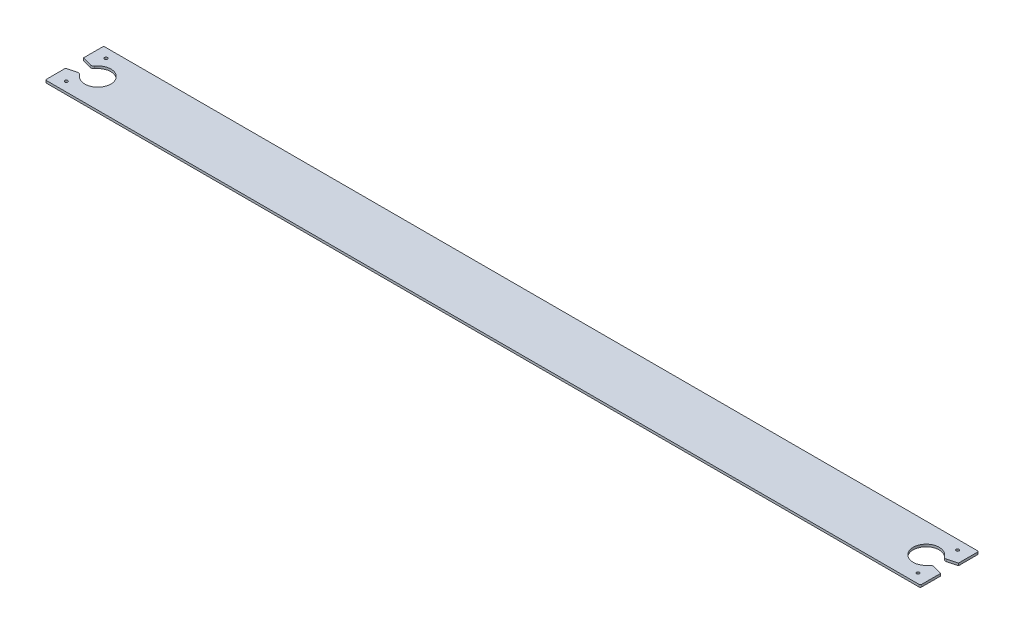
ISO-10303-21;
HEADER;
FILE_DESCRIPTION(('STEP AP214'),'2;1');
FILE_NAME('part.step','',(''),(''),'','','');
FILE_SCHEMA(('AUTOMOTIVE_DESIGN { 1 0 10303 214 1 1 1 1 }'));
ENDSEC;
DATA;
#1=APPLICATION_CONTEXT('core data for automotive mechanical design processes');
#2=APPLICATION_PROTOCOL_DEFINITION('international standard','automotive_design',2000,#1);
#3=PRODUCT_CONTEXT('',#1,'mechanical');
#4=PRODUCT('Part','Part','',(#3));
#5=PRODUCT_RELATED_PRODUCT_CATEGORY('part','',(#4));
#6=PRODUCT_DEFINITION_FORMATION('','',#4);
#7=PRODUCT_DEFINITION_CONTEXT('part definition',#1,'design');
#8=PRODUCT_DEFINITION('design','',#6,#7);
#9=PRODUCT_DEFINITION_SHAPE('','',#8);
#10=(LENGTH_UNIT() NAMED_UNIT(*) SI_UNIT(.MILLI.,.METRE.));
#11=(NAMED_UNIT(*) PLANE_ANGLE_UNIT() SI_UNIT($,.RADIAN.));
#12=(NAMED_UNIT(*) SI_UNIT($,.STERADIAN.) SOLID_ANGLE_UNIT());
#13=UNCERTAINTY_MEASURE_WITH_UNIT(LENGTH_MEASURE(1.E-05),#10,'distance_accuracy_value','');
#14=(GEOMETRIC_REPRESENTATION_CONTEXT(3) GLOBAL_UNCERTAINTY_ASSIGNED_CONTEXT((#13)) GLOBAL_UNIT_ASSIGNED_CONTEXT((#10,
#11,#12)) REPRESENTATION_CONTEXT('',''));
#15=CARTESIAN_POINT('',(0.,0.,0.));
#16=DIRECTION('',(0.,0.,1.));
#17=DIRECTION('',(1.,0.,0.));
#18=AXIS2_PLACEMENT_3D('',#15,#16,#17);
#19=CARTESIAN_POINT('',(0.,2.,0.));
#20=DIRECTION('',(1.,0.,0.));
#21=DIRECTION('',(0.,0.,-1.));
#22=AXIS2_PLACEMENT_3D('',#19,#20,#21);
#23=PLANE('',#22);
#24=DIRECTION('',(0.,0.,1.));
#25=VECTOR('',#24,1.);
#26=CARTESIAN_POINT('',(0.,0.,0.));
#27=LINE('',#26,#25);
#28=CARTESIAN_POINT('',(0.,0.,-49.));
#29=VERTEX_POINT('',#28);
#30=CARTESIAN_POINT('',(0.,0.,-32.6794919243113));
#31=VERTEX_POINT('',#30);
#32=EDGE_CURVE('E299',#29,#31,#27,.T.);
#33=ORIENTED_EDGE('',*,*,#32,.T.);
#34=DIRECTION('',(0.,1.,0.));
#35=VECTOR('',#34,1.);
#36=CARTESIAN_POINT('',(0.,-38.3694356943123,-32.6794919243113));
#37=LINE('',#36,#35);
#38=CARTESIAN_POINT('',(0.,2.,-32.6794919243113));
#39=VERTEX_POINT('',#38);
#40=EDGE_CURVE('E252',#31,#39,#37,.T.);
#41=ORIENTED_EDGE('',*,*,#40,.T.);
#42=DIRECTION('',(0.,0.,1.));
#43=VECTOR('',#42,1.);
#44=CARTESIAN_POINT('',(0.,2.,0.));
#45=LINE('',#44,#43);
#46=CARTESIAN_POINT('',(0.,2.,-49.));
#47=VERTEX_POINT('',#46);
#48=EDGE_CURVE('E284',#47,#39,#45,.T.);
#49=ORIENTED_EDGE('',*,*,#48,.F.);
#50=DIRECTION('',(0.,-1.,0.));
#51=VECTOR('',#50,1.);
#52=CARTESIAN_POINT('',(0.,2.,-49.));
#53=LINE('',#52,#51);
#54=EDGE_CURVE('E324',#47,#29,#53,.T.);
#55=ORIENTED_EDGE('',*,*,#54,.T.);
#56=EDGE_LOOP('',(#33,#41,#49,#55));
#57=FACE_BOUND('',#56,.T.);
#58=ADVANCED_FACE('F34',(#57),#23,.F.);
#59=CARTESIAN_POINT('',(750.,2.,0.));
#60=DIRECTION('',(-1.,0.,0.));
#61=DIRECTION('',(0.,0.,1.));
#62=AXIS2_PLACEMENT_3D('',#59,#60,#61);
#63=PLANE('',#62);
#64=DIRECTION('',(0.,0.,-1.));
#65=VECTOR('',#64,1.);
#66=CARTESIAN_POINT('',(750.,2.,0.));
#67=LINE('',#66,#65);
#68=CARTESIAN_POINT('',(750.,2.,-32.6794919243113));
#69=VERTEX_POINT('',#68);
#70=CARTESIAN_POINT('',(750.,2.,-49.0000000000001));
#71=VERTEX_POINT('',#70);
#72=EDGE_CURVE('E291',#69,#71,#67,.T.);
#73=ORIENTED_EDGE('',*,*,#72,.F.);
#74=DIRECTION('',(0.,1.,0.));
#75=VECTOR('',#74,1.);
#76=CARTESIAN_POINT('',(750.,-38.3694356943123,-32.6794919243113));
#77=LINE('',#76,#75);
#78=CARTESIAN_POINT('',(750.,0.,-32.6794919243113));
#79=VERTEX_POINT('',#78);
#80=EDGE_CURVE('E214',#79,#69,#77,.T.);
#81=ORIENTED_EDGE('',*,*,#80,.F.);
#82=DIRECTION('',(0.,0.,-1.));
#83=VECTOR('',#82,1.);
#84=CARTESIAN_POINT('',(750.,0.,0.));
#85=LINE('',#84,#83);
#86=CARTESIAN_POINT('',(750.,0.,-49.0000000000001));
#87=VERTEX_POINT('',#86);
#88=EDGE_CURVE('E195',#79,#87,#85,.T.);
#89=ORIENTED_EDGE('',*,*,#88,.T.);
#90=DIRECTION('',(0.,-1.,0.));
#91=VECTOR('',#90,1.);
#92=CARTESIAN_POINT('',(750.,2.,-49.0000000000001));
#93=LINE('',#92,#91);
#94=EDGE_CURVE('E11',#87,#71,#93,.F.);
#95=ORIENTED_EDGE('',*,*,#94,.T.);
#96=EDGE_LOOP('',(#73,#81,#89,#95));
#97=FACE_BOUND('',#96,.T.);
#98=ADVANCED_FACE('F414',(#97),#63,.F.);
#99=CARTESIAN_POINT('',(0.,2.,0.));
#100=DIRECTION('',(0.,-1.,0.));
#101=DIRECTION('',(0.,0.,-1.));
#102=AXIS2_PLACEMENT_3D('',#99,#100,#101);
#103=PLANE('',#102);
#104=CARTESIAN_POINT('',(741.167970771759,2.,-32.9011472761012));
#105=DIRECTION('',(0.,-1.,0.));
#106=DIRECTION('',(0.,0.,1.));
#107=AXIS2_PLACEMENT_3D('',#104,#105,#106);
#108=CIRCLE('',#107,2.49999999999995);
#109=CARTESIAN_POINT('',(741.815018384515,2.,-30.4863327103785));
#110=VERTEX_POINT('',#109);
#111=CARTESIAN_POINT('',(739.127091147495,2.,-31.4572600369908));
#112=VERTEX_POINT('',#111);
#113=EDGE_CURVE('E415',#110,#112,#108,.T.);
#114=ORIENTED_EDGE('',*,*,#113,.F.);
#115=DIRECTION('',(-0.965925826289071,0.,0.25881904510251));
#116=VECTOR('',#115,1.);
#117=CARTESIAN_POINT('',(741.815018384515,2.,-30.4863327103785));
#118=LINE('',#117,#116);
#119=EDGE_CURVE('E188',#69,#110,#118,.T.);
#120=ORIENTED_EDGE('',*,*,#119,.F.);
#121=ORIENTED_EDGE('',*,*,#72,.T.);
#122=CARTESIAN_POINT('',(749.,2.,-49.0000000000001));
#123=DIRECTION('',(0.,-1.,0.));
#124=DIRECTION('',(0.,0.,-1.));
#125=AXIS2_PLACEMENT_3D('',#122,#123,#124);
#126=CIRCLE('',#125,1.);
#127=CARTESIAN_POINT('',(749.,2.,-50.0000000000001));
#128=VERTEX_POINT('',#127);
#129=EDGE_CURVE('E332',#71,#128,#126,.F.);
#130=ORIENTED_EDGE('',*,*,#129,.T.);
#131=DIRECTION('',(-1.,0.,0.));
#132=VECTOR('',#131,1.);
#133=CARTESIAN_POINT('',(0.,2.,-50.));
#134=LINE('',#133,#132);
#135=CARTESIAN_POINT('',(1.,2.,-50.));
#136=VERTEX_POINT('',#135);
#137=EDGE_CURVE('E295',#128,#136,#134,.T.);
#138=ORIENTED_EDGE('',*,*,#137,.T.);
#139=CARTESIAN_POINT('',(1.,2.,-49.));
#140=DIRECTION('',(0.,-1.,0.));
#141=DIRECTION('',(0.,0.,-1.));
#142=AXIS2_PLACEMENT_3D('',#139,#140,#141);
#143=CIRCLE('',#142,1.);
#144=EDGE_CURVE('E334',#136,#47,#143,.F.);
#145=ORIENTED_EDGE('',*,*,#144,.T.);
#146=ORIENTED_EDGE('',*,*,#48,.T.);
#147=DIRECTION('',(-0.965925826289071,0.,-0.25881904510251));
#148=VECTOR('',#147,1.);
#149=CARTESIAN_POINT('',(8.1849816154852,2.,-30.4863327103785));
#150=LINE('',#149,#148);
#151=CARTESIAN_POINT('',(8.18498161548521,2.,-30.4863327103786));
#152=VERTEX_POINT('',#151);
#153=EDGE_CURVE('E227',#152,#39,#150,.T.);
#154=ORIENTED_EDGE('',*,*,#153,.F.);
#155=CARTESIAN_POINT('',(8.83202922824145,2.,-32.9011472761012));
#156=DIRECTION('',(0.,-1.,0.));
#157=DIRECTION('',(0.,0.,-1.));
#158=AXIS2_PLACEMENT_3D('',#155,#156,#157);
#159=CIRCLE('',#158,2.49999999999995);
#160=CARTESIAN_POINT('',(10.8729088525049,2.,-31.4572600369908));
#161=VERTEX_POINT('',#160);
#162=EDGE_CURVE('E229',#161,#152,#159,.T.);
#163=ORIENTED_EDGE('',*,*,#162,.F.);
#164=CARTESIAN_POINT('',(20.,2.,-25.0000000000001));
#165=DIRECTION('',(0.,1.,0.));
#166=DIRECTION('',(0.,0.,-1.));
#167=AXIS2_PLACEMENT_3D('',#164,#165,#166);
#168=CIRCLE('',#167,11.1803398874989);
#169=CARTESIAN_POINT('',(10.872908852505,2.,-18.5427399630094));
#170=VERTEX_POINT('',#169);
#171=EDGE_CURVE('E232',#170,#161,#168,.T.);
#172=ORIENTED_EDGE('',*,*,#171,.F.);
#173=CARTESIAN_POINT('',(8.83202922824145,2.,-17.098852723899));
#174=DIRECTION('',(0.,-1.,0.));
#175=DIRECTION('',(0.,0.,-1.));
#176=AXIS2_PLACEMENT_3D('',#173,#174,#175);
#177=CIRCLE('',#176,2.50000000000001);
#178=CARTESIAN_POINT('',(8.1849816154852,2.,-19.5136672896217));
#179=VERTEX_POINT('',#178);
#180=EDGE_CURVE('E220',#179,#170,#177,.T.);
#181=ORIENTED_EDGE('',*,*,#180,.F.);
#182=DIRECTION('',(0.965925826289072,0.,-0.258819045102508));
#183=VECTOR('',#182,1.);
#184=CARTESIAN_POINT('',(8.1849816154852,2.,-19.5136672896217));
#185=LINE('',#184,#183);
#186=CARTESIAN_POINT('',(0.,2.,-17.3205080756889));
#187=VERTEX_POINT('',#186);
#188=EDGE_CURVE('E224',#187,#179,#185,.T.);
#189=ORIENTED_EDGE('',*,*,#188,.F.);
#190=CARTESIAN_POINT('',(0.,2.,-1.));
#191=VERTEX_POINT('',#190);
#192=EDGE_CURVE('E288',#187,#191,#45,.T.);
#193=ORIENTED_EDGE('',*,*,#192,.T.);
#194=CARTESIAN_POINT('',(1.,2.,-1.));
#195=DIRECTION('',(0.,-1.,0.));
#196=DIRECTION('',(0.,0.,-1.));
#197=AXIS2_PLACEMENT_3D('',#194,#195,#196);
#198=CIRCLE('',#197,1.);
#199=CARTESIAN_POINT('',(1.,2.,0.));
#200=VERTEX_POINT('',#199);
#201=EDGE_CURVE('E336',#191,#200,#198,.F.);
#202=ORIENTED_EDGE('',*,*,#201,.T.);
#203=DIRECTION('',(1.,0.,0.));
#204=VECTOR('',#203,1.);
#205=CARTESIAN_POINT('',(0.,2.,0.));
#206=LINE('',#205,#204);
#207=CARTESIAN_POINT('',(749.,2.,0.));
#208=VERTEX_POINT('',#207);
#209=EDGE_CURVE('E287',#200,#208,#206,.T.);
#210=ORIENTED_EDGE('',*,*,#209,.T.);
#211=CARTESIAN_POINT('',(749.,2.,-1.00000000000009));
#212=DIRECTION('',(0.,-1.,0.));
#213=DIRECTION('',(0.,0.,-1.));
#214=AXIS2_PLACEMENT_3D('',#211,#212,#213);
#215=CIRCLE('',#214,1.);
#216=CARTESIAN_POINT('',(750.,2.,-1.00000000000009));
#217=VERTEX_POINT('',#216);
#218=EDGE_CURVE('E330',#208,#217,#215,.F.);
#219=ORIENTED_EDGE('',*,*,#218,.T.);
#220=CARTESIAN_POINT('',(750.,2.,-17.3205080756889));
#221=VERTEX_POINT('',#220);
#222=EDGE_CURVE('E292',#217,#221,#67,.T.);
#223=ORIENTED_EDGE('',*,*,#222,.T.);
#224=DIRECTION('',(0.965925826289071,0.,0.25881904510251));
#225=VECTOR('',#224,1.);
#226=CARTESIAN_POINT('',(741.815018384515,2.,-19.5136672896217));
#227=LINE('',#226,#225);
#228=CARTESIAN_POINT('',(741.815018384515,2.,-19.5136672896216));
#229=VERTEX_POINT('',#228);
#230=EDGE_CURVE('E57',#229,#221,#227,.T.);
#231=ORIENTED_EDGE('',*,*,#230,.F.);
#232=CARTESIAN_POINT('',(741.167970771759,2.,-17.098852723899));
#233=DIRECTION('',(0.,-1.,0.));
#234=DIRECTION('',(0.,0.,1.));
#235=AXIS2_PLACEMENT_3D('',#232,#233,#234);
#236=CIRCLE('',#235,2.49999999999997);
#237=CARTESIAN_POINT('',(739.127091147495,2.,-18.5427399630094));
#238=VERTEX_POINT('',#237);
#239=EDGE_CURVE('E197',#238,#229,#236,.T.);
#240=ORIENTED_EDGE('',*,*,#239,.F.);
#241=CARTESIAN_POINT('',(730.,2.,-25.0000000000001));
#242=DIRECTION('',(0.,1.,0.));
#243=DIRECTION('',(0.,0.,1.));
#244=AXIS2_PLACEMENT_3D('',#241,#242,#243);
#245=CIRCLE('',#244,11.180339887499);
#246=EDGE_CURVE('E361',#112,#238,#245,.T.);
#247=ORIENTED_EDGE('',*,*,#246,.F.);
#248=EDGE_LOOP('',(#114,#120,#121,#130,#138,#145,#146,#154,#163,#172,#181,#189,#193,#202,#210,
#219,#223,#231,#240,#247));
#249=FACE_BOUND('',#248,.T.);
#250=CARTESIAN_POINT('',(10.,2.,-42.));
#251=DIRECTION('',(0.,1.,0.));
#252=DIRECTION('',(0.,0.,1.));
#253=AXIS2_PLACEMENT_3D('',#250,#251,#252);
#254=CIRCLE('',#253,1.25);
#255=CARTESIAN_POINT('',(10.,2.,-40.75));
#256=VERTEX_POINT('',#255);
#257=EDGE_CURVE('E278',#256,#256,#254,.T.);
#258=ORIENTED_EDGE('',*,*,#257,.F.);
#259=EDGE_LOOP('',(#258));
#260=FACE_BOUND('',#259,.T.);
#261=CARTESIAN_POINT('',(10.,2.,-8.));
#262=DIRECTION('',(0.,1.,0.));
#263=DIRECTION('',(0.,0.,1.));
#264=AXIS2_PLACEMENT_3D('',#261,#262,#263);
#265=CIRCLE('',#264,1.25);
#266=CARTESIAN_POINT('',(10.,2.,-6.75));
#267=VERTEX_POINT('',#266);
#268=EDGE_CURVE('E272',#267,#267,#265,.T.);
#269=ORIENTED_EDGE('',*,*,#268,.F.);
#270=EDGE_LOOP('',(#269));
#271=FACE_BOUND('',#270,.T.);
#272=CARTESIAN_POINT('',(740.,2.,-8.00000000000009));
#273=DIRECTION('',(0.,1.,0.));
#274=DIRECTION('',(0.,0.,-1.));
#275=AXIS2_PLACEMENT_3D('',#272,#273,#274);
#276=CIRCLE('',#275,1.24999999999996);
#277=CARTESIAN_POINT('',(740.,2.,-9.25000000000005));
#278=VERTEX_POINT('',#277);
#279=EDGE_CURVE('E266',#278,#278,#276,.T.);
#280=ORIENTED_EDGE('',*,*,#279,.F.);
#281=EDGE_LOOP('',(#280));
#282=FACE_BOUND('',#281,.T.);
#283=CARTESIAN_POINT('',(740.,2.,-42.0000000000001));
#284=DIRECTION('',(0.,1.,0.));
#285=DIRECTION('',(0.,0.,-1.));
#286=AXIS2_PLACEMENT_3D('',#283,#284,#285);
#287=CIRCLE('',#286,1.24999999999996);
#288=CARTESIAN_POINT('',(740.,2.,-43.25));
#289=VERTEX_POINT('',#288);
#290=EDGE_CURVE('E260',#289,#289,#287,.T.);
#291=ORIENTED_EDGE('',*,*,#290,.F.);
#292=EDGE_LOOP('',(#291));
#293=FACE_BOUND('',#292,.T.);
#294=ADVANCED_FACE('F363',(#249,#260,#271,#282,#293),#103,.F.);
#295=CARTESIAN_POINT('',(0.,0.,0.));
#296=DIRECTION('',(0.,-1.,0.));
#297=DIRECTION('',(0.,0.,-1.));
#298=AXIS2_PLACEMENT_3D('',#295,#296,#297);
#299=PLANE('',#298);
#300=DIRECTION('',(-0.965925826289071,0.,0.25881904510251));
#301=VECTOR('',#300,1.);
#302=CARTESIAN_POINT('',(741.815018384515,0.,-30.4863327103785));
#303=LINE('',#302,#301);
#304=CARTESIAN_POINT('',(741.815018384515,0.,-30.4863327103785));
#305=VERTEX_POINT('',#304);
#306=EDGE_CURVE('E185',#79,#305,#303,.T.);
#307=ORIENTED_EDGE('',*,*,#306,.T.);
#308=CARTESIAN_POINT('',(741.167970771759,0.,-32.9011472761012));
#309=DIRECTION('',(0.,-1.,0.));
#310=DIRECTION('',(0.,0.,-1.));
#311=AXIS2_PLACEMENT_3D('',#308,#309,#310);
#312=CIRCLE('',#311,2.49999999999995);
#313=CARTESIAN_POINT('',(739.127091147495,0.,-31.4572600369908));
#314=VERTEX_POINT('',#313);
#315=EDGE_CURVE('E172',#305,#314,#312,.T.);
#316=ORIENTED_EDGE('',*,*,#315,.T.);
#317=CARTESIAN_POINT('',(730.,0.,-25.0000000000001));
#318=DIRECTION('',(0.,-1.,0.));
#319=DIRECTION('',(0.,0.,-1.));
#320=AXIS2_PLACEMENT_3D('',#317,#318,#319);
#321=CIRCLE('',#320,11.180339887499);
#322=CARTESIAN_POINT('',(739.127091147495,0.,-18.5427399630094));
#323=VERTEX_POINT('',#322);
#324=EDGE_CURVE('E211',#314,#323,#321,.F.);
#325=ORIENTED_EDGE('',*,*,#324,.T.);
#326=CARTESIAN_POINT('',(741.167970771759,0.,-17.098852723899));
#327=DIRECTION('',(0.,-1.,0.));
#328=DIRECTION('',(0.,0.,-1.));
#329=AXIS2_PLACEMENT_3D('',#326,#327,#328);
#330=CIRCLE('',#329,2.49999999999997);
#331=CARTESIAN_POINT('',(741.815018384515,0.,-19.5136672896216));
#332=VERTEX_POINT('',#331);
#333=EDGE_CURVE('E207',#323,#332,#330,.T.);
#334=ORIENTED_EDGE('',*,*,#333,.T.);
#335=DIRECTION('',(0.965925826289071,0.,0.25881904510251));
#336=VECTOR('',#335,1.);
#337=CARTESIAN_POINT('',(741.815018384515,0.,-19.5136672896217));
#338=LINE('',#337,#336);
#339=CARTESIAN_POINT('',(750.,0.,-17.3205080756889));
#340=VERTEX_POINT('',#339);
#341=EDGE_CURVE('E202',#332,#340,#338,.T.);
#342=ORIENTED_EDGE('',*,*,#341,.T.);
#343=CARTESIAN_POINT('',(750.,0.,-1.00000000000009));
#344=VERTEX_POINT('',#343);
#345=EDGE_CURVE('E305',#344,#340,#85,.T.);
#346=ORIENTED_EDGE('',*,*,#345,.F.);
#347=CARTESIAN_POINT('',(749.,0.,-1.00000000000009));
#348=DIRECTION('',(0.,-1.,0.));
#349=DIRECTION('',(0.,0.,-1.));
#350=AXIS2_PLACEMENT_3D('',#347,#348,#349);
#351=CIRCLE('',#350,1.);
#352=CARTESIAN_POINT('',(749.,0.,0.));
#353=VERTEX_POINT('',#352);
#354=EDGE_CURVE('E315',#344,#353,#351,.T.);
#355=ORIENTED_EDGE('',*,*,#354,.T.);
#356=DIRECTION('',(1.,0.,0.));
#357=VECTOR('',#356,1.);
#358=CARTESIAN_POINT('',(0.,0.,0.));
#359=LINE('',#358,#357);
#360=CARTESIAN_POINT('',(1.,0.,0.));
#361=VERTEX_POINT('',#360);
#362=EDGE_CURVE('E302',#361,#353,#359,.T.);
#363=ORIENTED_EDGE('',*,*,#362,.F.);
#364=CARTESIAN_POINT('',(1.,0.,-1.));
#365=DIRECTION('',(0.,-1.,0.));
#366=DIRECTION('',(0.,0.,-1.));
#367=AXIS2_PLACEMENT_3D('',#364,#365,#366);
#368=CIRCLE('',#367,1.);
#369=CARTESIAN_POINT('',(0.,0.,-1.));
#370=VERTEX_POINT('',#369);
#371=EDGE_CURVE('E321',#361,#370,#368,.T.);
#372=ORIENTED_EDGE('',*,*,#371,.T.);
#373=CARTESIAN_POINT('',(0.,0.,-17.3205080756889));
#374=VERTEX_POINT('',#373);
#375=EDGE_CURVE('E281',#374,#370,#27,.T.);
#376=ORIENTED_EDGE('',*,*,#375,.F.);
#377=DIRECTION('',(0.965925826289072,0.,-0.258819045102508));
#378=VECTOR('',#377,1.);
#379=CARTESIAN_POINT('',(8.1849816154852,0.,-19.5136672896217));
#380=LINE('',#379,#378);
#381=CARTESIAN_POINT('',(8.1849816154852,0.,-19.5136672896217));
#382=VERTEX_POINT('',#381);
#383=EDGE_CURVE('E49',#374,#382,#380,.T.);
#384=ORIENTED_EDGE('',*,*,#383,.T.);
#385=CARTESIAN_POINT('',(8.83202922824145,0.,-17.098852723899));
#386=DIRECTION('',(0.,-1.,0.));
#387=DIRECTION('',(0.,0.,-1.));
#388=AXIS2_PLACEMENT_3D('',#385,#386,#387);
#389=CIRCLE('',#388,2.50000000000001);
#390=CARTESIAN_POINT('',(10.872908852505,0.,-18.5427399630094));
#391=VERTEX_POINT('',#390);
#392=EDGE_CURVE('E243',#382,#391,#389,.T.);
#393=ORIENTED_EDGE('',*,*,#392,.T.);
#394=CARTESIAN_POINT('',(20.,0.,-25.0000000000001));
#395=DIRECTION('',(0.,-1.,0.));
#396=DIRECTION('',(0.,0.,-1.));
#397=AXIS2_PLACEMENT_3D('',#394,#395,#396);
#398=CIRCLE('',#397,11.1803398874989);
#399=CARTESIAN_POINT('',(10.8729088525049,0.,-31.4572600369908));
#400=VERTEX_POINT('',#399);
#401=EDGE_CURVE('E238',#391,#400,#398,.F.);
#402=ORIENTED_EDGE('',*,*,#401,.T.);
#403=CARTESIAN_POINT('',(8.83202922824145,0.,-32.9011472761012));
#404=DIRECTION('',(0.,-1.,0.));
#405=DIRECTION('',(0.,0.,-1.));
#406=AXIS2_PLACEMENT_3D('',#403,#404,#405);
#407=CIRCLE('',#406,2.49999999999995);
#408=CARTESIAN_POINT('',(8.18498161548521,0.,-30.4863327103786));
#409=VERTEX_POINT('',#408);
#410=EDGE_CURVE('E223',#400,#409,#407,.T.);
#411=ORIENTED_EDGE('',*,*,#410,.T.);
#412=DIRECTION('',(-0.965925826289071,0.,-0.25881904510251));
#413=VECTOR('',#412,1.);
#414=CARTESIAN_POINT('',(8.1849816154852,0.,-30.4863327103785));
#415=LINE('',#414,#413);
#416=EDGE_CURVE('E249',#409,#31,#415,.T.);
#417=ORIENTED_EDGE('',*,*,#416,.T.);
#418=ORIENTED_EDGE('',*,*,#32,.F.);
#419=CARTESIAN_POINT('',(1.,0.,-49.));
#420=DIRECTION('',(0.,-1.,0.));
#421=DIRECTION('',(0.,0.,-1.));
#422=AXIS2_PLACEMENT_3D('',#419,#420,#421);
#423=CIRCLE('',#422,1.);
#424=CARTESIAN_POINT('',(1.,0.,-50.));
#425=VERTEX_POINT('',#424);
#426=EDGE_CURVE('E319',#29,#425,#423,.T.);
#427=ORIENTED_EDGE('',*,*,#426,.T.);
#428=DIRECTION('',(-1.,0.,0.));
#429=VECTOR('',#428,1.);
#430=CARTESIAN_POINT('',(0.,0.,-50.));
#431=LINE('',#430,#429);
#432=CARTESIAN_POINT('',(749.,0.,-50.0000000000001));
#433=VERTEX_POINT('',#432);
#434=EDGE_CURVE('E308',#433,#425,#431,.T.);
#435=ORIENTED_EDGE('',*,*,#434,.F.);
#436=CARTESIAN_POINT('',(749.,0.,-49.0000000000001));
#437=DIRECTION('',(0.,-1.,0.));
#438=DIRECTION('',(0.,0.,-1.));
#439=AXIS2_PLACEMENT_3D('',#436,#437,#438);
#440=CIRCLE('',#439,1.);
#441=EDGE_CURVE('E317',#433,#87,#440,.T.);
#442=ORIENTED_EDGE('',*,*,#441,.T.);
#443=ORIENTED_EDGE('',*,*,#88,.F.);
#444=EDGE_LOOP('',(#307,#316,#325,#334,#342,#346,#355,#363,#372,#376,#384,#393,#402,#411,#417,
#418,#427,#435,#442,#443));
#445=FACE_BOUND('',#444,.T.);
#446=CARTESIAN_POINT('',(740.,0.,-8.00000000000009));
#447=DIRECTION('',(0.,1.,0.));
#448=DIRECTION('',(0.,0.,-1.));
#449=AXIS2_PLACEMENT_3D('',#446,#447,#448);
#450=CIRCLE('',#449,1.24999999999996);
#451=CARTESIAN_POINT('',(740.,0.,-9.25000000000005));
#452=VERTEX_POINT('',#451);
#453=EDGE_CURVE('E263',#452,#452,#450,.T.);
#454=ORIENTED_EDGE('',*,*,#453,.T.);
#455=EDGE_LOOP('',(#454));
#456=FACE_BOUND('',#455,.T.);
#457=CARTESIAN_POINT('',(10.,0.,-42.));
#458=DIRECTION('',(0.,1.,0.));
#459=DIRECTION('',(0.,0.,1.));
#460=AXIS2_PLACEMENT_3D('',#457,#458,#459);
#461=CIRCLE('',#460,1.25);
#462=CARTESIAN_POINT('',(10.,0.,-40.75));
#463=VERTEX_POINT('',#462);
#464=EDGE_CURVE('E275',#463,#463,#461,.T.);
#465=ORIENTED_EDGE('',*,*,#464,.T.);
#466=EDGE_LOOP('',(#465));
#467=FACE_BOUND('',#466,.T.);
#468=CARTESIAN_POINT('',(10.,0.,-8.));
#469=DIRECTION('',(0.,1.,0.));
#470=DIRECTION('',(0.,0.,1.));
#471=AXIS2_PLACEMENT_3D('',#468,#469,#470);
#472=CIRCLE('',#471,1.25);
#473=CARTESIAN_POINT('',(10.,0.,-6.75));
#474=VERTEX_POINT('',#473);
#475=EDGE_CURVE('E269',#474,#474,#472,.T.);
#476=ORIENTED_EDGE('',*,*,#475,.T.);
#477=EDGE_LOOP('',(#476));
#478=FACE_BOUND('',#477,.T.);
#479=CARTESIAN_POINT('',(740.,0.,-42.0000000000001));
#480=DIRECTION('',(0.,1.,0.));
#481=DIRECTION('',(0.,0.,-1.));
#482=AXIS2_PLACEMENT_3D('',#479,#480,#481);
#483=CIRCLE('',#482,1.24999999999996);
#484=CARTESIAN_POINT('',(740.,0.,-43.25));
#485=VERTEX_POINT('',#484);
#486=EDGE_CURVE('E219',#485,#485,#483,.T.);
#487=ORIENTED_EDGE('',*,*,#486,.T.);
#488=EDGE_LOOP('',(#487));
#489=FACE_BOUND('',#488,.T.);
#490=ADVANCED_FACE('F192',(#445,#456,#467,#478,#489),#299,.T.);
#491=ORIENTED_EDGE('',*,*,#192,.F.);
#492=DIRECTION('',(0.,1.,0.));
#493=VECTOR('',#492,1.);
#494=CARTESIAN_POINT('',(0.,-38.3694356943123,-17.3205080756889));
#495=LINE('',#494,#493);
#496=EDGE_CURVE('E248',#374,#187,#495,.T.);
#497=ORIENTED_EDGE('',*,*,#496,.F.);
#498=ORIENTED_EDGE('',*,*,#375,.T.);
#499=DIRECTION('',(0.,-1.,0.));
#500=VECTOR('',#499,1.);
#501=CARTESIAN_POINT('',(0.,2.,-1.));
#502=LINE('',#501,#500);
#503=EDGE_CURVE('E327',#370,#191,#502,.F.);
#504=ORIENTED_EDGE('',*,*,#503,.T.);
#505=EDGE_LOOP('',(#491,#497,#498,#504));
#506=FACE_BOUND('',#505,.T.);
#507=ADVANCED_FACE('F377',(#506),#23,.F.);
#508=CARTESIAN_POINT('',(0.,2.,0.));
#509=DIRECTION('',(0.,0.,-1.));
#510=DIRECTION('',(-1.,0.,0.));
#511=AXIS2_PLACEMENT_3D('',#508,#509,#510);
#512=PLANE('',#511);
#513=ORIENTED_EDGE('',*,*,#209,.F.);
#514=DIRECTION('',(0.,-1.,0.));
#515=VECTOR('',#514,1.);
#516=CARTESIAN_POINT('',(1.,2.,0.));
#517=LINE('',#516,#515);
#518=EDGE_CURVE('E312',#200,#361,#517,.T.);
#519=ORIENTED_EDGE('',*,*,#518,.T.);
#520=ORIENTED_EDGE('',*,*,#362,.T.);
#521=DIRECTION('',(0.,-1.,0.));
#522=VECTOR('',#521,1.);
#523=CARTESIAN_POINT('',(749.,2.,0.));
#524=LINE('',#523,#522);
#525=EDGE_CURVE('E298',#353,#208,#524,.F.);
#526=ORIENTED_EDGE('',*,*,#525,.T.);
#527=EDGE_LOOP('',(#513,#519,#520,#526));
#528=FACE_BOUND('',#527,.T.);
#529=ADVANCED_FACE('F368',(#528),#512,.F.);
#530=ORIENTED_EDGE('',*,*,#345,.T.);
#531=DIRECTION('',(0.,1.,0.));
#532=VECTOR('',#531,1.);
#533=CARTESIAN_POINT('',(750.,-38.3694356943123,-17.3205080756889));
#534=LINE('',#533,#532);
#535=EDGE_CURVE('E205',#340,#221,#534,.T.);
#536=ORIENTED_EDGE('',*,*,#535,.T.);
#537=ORIENTED_EDGE('',*,*,#222,.F.);
#538=DIRECTION('',(0.,-1.,0.));
#539=VECTOR('',#538,1.);
#540=CARTESIAN_POINT('',(750.,2.,-1.00000000000009));
#541=LINE('',#540,#539);
#542=EDGE_CURVE('E42',#217,#344,#541,.T.);
#543=ORIENTED_EDGE('',*,*,#542,.T.);
#544=EDGE_LOOP('',(#530,#536,#537,#543));
#545=FACE_BOUND('',#544,.T.);
#546=ADVANCED_FACE('F347',(#545),#63,.F.);
#547=CARTESIAN_POINT('',(0.,2.,-50.));
#548=DIRECTION('',(0.,0.,1.));
#549=DIRECTION('',(1.,0.,0.));
#550=AXIS2_PLACEMENT_3D('',#547,#548,#549);
#551=PLANE('',#550);
#552=ORIENTED_EDGE('',*,*,#434,.T.);
#553=DIRECTION('',(0.,-1.,0.));
#554=VECTOR('',#553,1.);
#555=CARTESIAN_POINT('',(1.,2.,-50.));
#556=LINE('',#555,#554);
#557=EDGE_CURVE('E341',#425,#136,#556,.F.);
#558=ORIENTED_EDGE('',*,*,#557,.T.);
#559=ORIENTED_EDGE('',*,*,#137,.F.);
#560=DIRECTION('',(0.,-1.,0.));
#561=VECTOR('',#560,1.);
#562=CARTESIAN_POINT('',(749.,2.,-50.0000000000001));
#563=LINE('',#562,#561);
#564=EDGE_CURVE('E338',#128,#433,#563,.T.);
#565=ORIENTED_EDGE('',*,*,#564,.T.);
#566=EDGE_LOOP('',(#552,#558,#559,#565));
#567=FACE_BOUND('',#566,.T.);
#568=ADVANCED_FACE('F405',(#567),#551,.F.);
#569=CARTESIAN_POINT('',(10.,2.,-42.));
#570=DIRECTION('',(0.,-1.,0.));
#571=DIRECTION('',(0.,0.,-1.));
#572=AXIS2_PLACEMENT_3D('',#569,#570,#571);
#573=CYLINDRICAL_SURFACE('',#572,1.25);
#574=ORIENTED_EDGE('',*,*,#257,.T.);
#575=EDGE_LOOP('',(#574));
#576=FACE_BOUND('',#575,.T.);
#577=ORIENTED_EDGE('',*,*,#464,.F.);
#578=EDGE_LOOP('',(#577));
#579=FACE_BOUND('',#578,.T.);
#580=ADVANCED_FACE('F448',(#576,#579),#573,.F.);
#581=CARTESIAN_POINT('',(10.,2.,-8.));
#582=DIRECTION('',(0.,-1.,0.));
#583=DIRECTION('',(0.,0.,-1.));
#584=AXIS2_PLACEMENT_3D('',#581,#582,#583);
#585=CYLINDRICAL_SURFACE('',#584,1.25);
#586=ORIENTED_EDGE('',*,*,#268,.T.);
#587=EDGE_LOOP('',(#586));
#588=FACE_BOUND('',#587,.T.);
#589=ORIENTED_EDGE('',*,*,#475,.F.);
#590=EDGE_LOOP('',(#589));
#591=FACE_BOUND('',#590,.T.);
#592=ADVANCED_FACE('F466',(#588,#591),#585,.F.);
#593=CARTESIAN_POINT('',(740.,2.,-8.00000000000009));
#594=DIRECTION('',(0.,-1.,0.));
#595=DIRECTION('',(0.,0.,-1.));
#596=AXIS2_PLACEMENT_3D('',#593,#594,#595);
#597=CYLINDRICAL_SURFACE('',#596,1.24999999999996);
#598=ORIENTED_EDGE('',*,*,#279,.T.);
#599=EDGE_LOOP('',(#598));
#600=FACE_BOUND('',#599,.T.);
#601=ORIENTED_EDGE('',*,*,#453,.F.);
#602=EDGE_LOOP('',(#601));
#603=FACE_BOUND('',#602,.T.);
#604=ADVANCED_FACE('F473',(#600,#603),#597,.F.);
#605=CARTESIAN_POINT('',(740.,2.,-42.0000000000001));
#606=DIRECTION('',(0.,-1.,0.));
#607=DIRECTION('',(0.,0.,-1.));
#608=AXIS2_PLACEMENT_3D('',#605,#606,#607);
#609=CYLINDRICAL_SURFACE('',#608,1.24999999999996);
#610=ORIENTED_EDGE('',*,*,#290,.T.);
#611=EDGE_LOOP('',(#610));
#612=FACE_BOUND('',#611,.T.);
#613=ORIENTED_EDGE('',*,*,#486,.F.);
#614=EDGE_LOOP('',(#613));
#615=FACE_BOUND('',#614,.T.);
#616=ADVANCED_FACE('F481',(#612,#615),#609,.F.);
#617=CARTESIAN_POINT('',(1.,2.,-1.));
#618=DIRECTION('',(0.,-1.,0.));
#619=DIRECTION('',(0.,0.,-1.));
#620=AXIS2_PLACEMENT_3D('',#617,#618,#619);
#621=CYLINDRICAL_SURFACE('',#620,1.);
#622=ORIENTED_EDGE('',*,*,#201,.F.);
#623=ORIENTED_EDGE('',*,*,#503,.F.);
#624=ORIENTED_EDGE('',*,*,#371,.F.);
#625=ORIENTED_EDGE('',*,*,#518,.F.);
#626=EDGE_LOOP('',(#622,#623,#624,#625));
#627=FACE_BOUND('',#626,.T.);
#628=ADVANCED_FACE('F374',(#627),#621,.T.);
#629=CARTESIAN_POINT('',(1.,2.,-49.));
#630=DIRECTION('',(0.,-1.,0.));
#631=DIRECTION('',(0.,0.,-1.));
#632=AXIS2_PLACEMENT_3D('',#629,#630,#631);
#633=CYLINDRICAL_SURFACE('',#632,1.);
#634=ORIENTED_EDGE('',*,*,#144,.F.);
#635=ORIENTED_EDGE('',*,*,#557,.F.);
#636=ORIENTED_EDGE('',*,*,#426,.F.);
#637=ORIENTED_EDGE('',*,*,#54,.F.);
#638=EDGE_LOOP('',(#634,#635,#636,#637));
#639=FACE_BOUND('',#638,.T.);
#640=ADVANCED_FACE('F401',(#639),#633,.T.);
#641=CARTESIAN_POINT('',(749.,2.,-49.0000000000001));
#642=DIRECTION('',(0.,-1.,0.));
#643=DIRECTION('',(0.,0.,-1.));
#644=AXIS2_PLACEMENT_3D('',#641,#642,#643);
#645=CYLINDRICAL_SURFACE('',#644,1.);
#646=ORIENTED_EDGE('',*,*,#129,.F.);
#647=ORIENTED_EDGE('',*,*,#94,.F.);
#648=ORIENTED_EDGE('',*,*,#441,.F.);
#649=ORIENTED_EDGE('',*,*,#564,.F.);
#650=EDGE_LOOP('',(#646,#647,#648,#649));
#651=FACE_BOUND('',#650,.T.);
#652=ADVANCED_FACE('F410',(#651),#645,.T.);
#653=CARTESIAN_POINT('',(749.,2.,-1.00000000000009));
#654=DIRECTION('',(0.,-1.,0.));
#655=DIRECTION('',(0.,0.,-1.));
#656=AXIS2_PLACEMENT_3D('',#653,#654,#655);
#657=CYLINDRICAL_SURFACE('',#656,1.);
#658=ORIENTED_EDGE('',*,*,#218,.F.);
#659=ORIENTED_EDGE('',*,*,#525,.F.);
#660=ORIENTED_EDGE('',*,*,#354,.F.);
#661=ORIENTED_EDGE('',*,*,#542,.F.);
#662=EDGE_LOOP('',(#658,#659,#660,#661));
#663=FACE_BOUND('',#662,.T.);
#664=ADVANCED_FACE('F36',(#663),#657,.T.);
#665=CARTESIAN_POINT('',(741.815018384515,-38.3694356943123,-30.4863327103785));
#666=DIRECTION('',(-0.25881904510251,0.,-0.965925826289071));
#667=DIRECTION('',(-0.965925826289071,0.,0.25881904510251));
#668=AXIS2_PLACEMENT_3D('',#665,#666,#667);
#669=PLANE('',#668);
#670=ORIENTED_EDGE('',*,*,#80,.T.);
#671=ORIENTED_EDGE('',*,*,#119,.T.);
#672=DIRECTION('',(0.,1.,0.));
#673=VECTOR('',#672,1.);
#674=CARTESIAN_POINT('',(741.815018384515,-38.3694356943123,-30.4863327103785));
#675=LINE('',#674,#673);
#676=EDGE_CURVE('E176',#305,#110,#675,.T.);
#677=ORIENTED_EDGE('',*,*,#676,.F.);
#678=ORIENTED_EDGE('',*,*,#306,.F.);
#679=EDGE_LOOP('',(#670,#671,#677,#678));
#680=FACE_BOUND('',#679,.T.);
#681=ADVANCED_FACE('F184',(#680),#669,.F.);
#682=CARTESIAN_POINT('',(741.167970771759,-38.3694356943123,-32.9011472761012));
#683=DIRECTION('',(0.,1.,0.));
#684=DIRECTION('',(0.,0.,1.));
#685=AXIS2_PLACEMENT_3D('',#682,#683,#684);
#686=CYLINDRICAL_SURFACE('',#685,2.49999999999995);
#687=ORIENTED_EDGE('',*,*,#676,.T.);
#688=ORIENTED_EDGE('',*,*,#113,.T.);
#689=DIRECTION('',(0.,1.,0.));
#690=VECTOR('',#689,1.);
#691=CARTESIAN_POINT('',(739.127091147495,-38.3694356943123,-31.4572600369908));
#692=LINE('',#691,#690);
#693=EDGE_CURVE('E178',#314,#112,#692,.T.);
#694=ORIENTED_EDGE('',*,*,#693,.F.);
#695=ORIENTED_EDGE('',*,*,#315,.F.);
#696=EDGE_LOOP('',(#687,#688,#694,#695));
#697=FACE_BOUND('',#696,.T.);
#698=ADVANCED_FACE('F174',(#697),#686,.T.);
#699=CARTESIAN_POINT('',(730.,-38.3694356943123,-25.0000000000001));
#700=DIRECTION('',(0.,1.,0.));
#701=DIRECTION('',(0.,0.,1.));
#702=AXIS2_PLACEMENT_3D('',#699,#700,#701);
#703=CYLINDRICAL_SURFACE('',#702,11.180339887499);
#704=ORIENTED_EDGE('',*,*,#693,.T.);
#705=ORIENTED_EDGE('',*,*,#246,.T.);
#706=DIRECTION('',(0.,1.,0.));
#707=VECTOR('',#706,1.);
#708=CARTESIAN_POINT('',(739.127091147495,-38.3694356943123,-18.5427399630094));
#709=LINE('',#708,#707);
#710=EDGE_CURVE('E210',#323,#238,#709,.T.);
#711=ORIENTED_EDGE('',*,*,#710,.F.);
#712=ORIENTED_EDGE('',*,*,#324,.F.);
#713=EDGE_LOOP('',(#704,#705,#711,#712));
#714=FACE_BOUND('',#713,.T.);
#715=ADVANCED_FACE('F418',(#714),#703,.F.);
#716=CARTESIAN_POINT('',(741.167970771759,-38.3694356943123,-17.098852723899));
#717=DIRECTION('',(0.,1.,0.));
#718=DIRECTION('',(0.,0.,1.));
#719=AXIS2_PLACEMENT_3D('',#716,#717,#718);
#720=CYLINDRICAL_SURFACE('',#719,2.49999999999997);
#721=ORIENTED_EDGE('',*,*,#710,.T.);
#722=ORIENTED_EDGE('',*,*,#239,.T.);
#723=DIRECTION('',(0.,1.,0.));
#724=VECTOR('',#723,1.);
#725=CARTESIAN_POINT('',(741.815018384515,-38.3694356943123,-19.5136672896216));
#726=LINE('',#725,#724);
#727=EDGE_CURVE('E206',#332,#229,#726,.T.);
#728=ORIENTED_EDGE('',*,*,#727,.F.);
#729=ORIENTED_EDGE('',*,*,#333,.F.);
#730=EDGE_LOOP('',(#721,#722,#728,#729));
#731=FACE_BOUND('',#730,.T.);
#732=ADVANCED_FACE('F355',(#731),#720,.T.);
#733=CARTESIAN_POINT('',(741.815018384515,-38.3694356943123,-19.5136672896217));
#734=DIRECTION('',(-0.25881904510251,0.,0.965925826289071));
#735=DIRECTION('',(0.965925826289071,0.,0.25881904510251));
#736=AXIS2_PLACEMENT_3D('',#733,#734,#735);
#737=PLANE('',#736);
#738=ORIENTED_EDGE('',*,*,#727,.T.);
#739=ORIENTED_EDGE('',*,*,#230,.T.);
#740=ORIENTED_EDGE('',*,*,#535,.F.);
#741=ORIENTED_EDGE('',*,*,#341,.F.);
#742=EDGE_LOOP('',(#738,#739,#740,#741));
#743=FACE_BOUND('',#742,.T.);
#744=ADVANCED_FACE('F352',(#743),#737,.F.);
#745=CARTESIAN_POINT('',(8.83202922824145,-38.3694356943123,-32.9011472761012));
#746=DIRECTION('',(0.,1.,0.));
#747=DIRECTION('',(0.,0.,1.));
#748=AXIS2_PLACEMENT_3D('',#745,#746,#747);
#749=CYLINDRICAL_SURFACE('',#748,2.49999999999995);
#750=DIRECTION('',(0.,1.,0.));
#751=VECTOR('',#750,1.);
#752=CARTESIAN_POINT('',(10.8729088525049,-38.3694356943123,-31.4572600369908));
#753=LINE('',#752,#751);
#754=EDGE_CURVE('E241',#400,#161,#753,.T.);
#755=ORIENTED_EDGE('',*,*,#754,.T.);
#756=ORIENTED_EDGE('',*,*,#162,.T.);
#757=DIRECTION('',(0.,1.,0.));
#758=VECTOR('',#757,1.);
#759=CARTESIAN_POINT('',(8.18498161548521,-38.3694356943123,-30.4863327103786));
#760=LINE('',#759,#758);
#761=EDGE_CURVE('E237',#409,#152,#760,.T.);
#762=ORIENTED_EDGE('',*,*,#761,.F.);
#763=ORIENTED_EDGE('',*,*,#410,.F.);
#764=EDGE_LOOP('',(#755,#756,#762,#763));
#765=FACE_BOUND('',#764,.T.);
#766=ADVANCED_FACE('F390',(#765),#749,.T.);
#767=CARTESIAN_POINT('',(8.1849816154852,-38.3694356943123,-30.4863327103785));
#768=DIRECTION('',(0.25881904510251,0.,-0.965925826289071));
#769=DIRECTION('',(-0.965925826289071,0.,-0.25881904510251));
#770=AXIS2_PLACEMENT_3D('',#767,#768,#769);
#771=PLANE('',#770);
#772=ORIENTED_EDGE('',*,*,#761,.T.);
#773=ORIENTED_EDGE('',*,*,#153,.T.);
#774=ORIENTED_EDGE('',*,*,#40,.F.);
#775=ORIENTED_EDGE('',*,*,#416,.F.);
#776=EDGE_LOOP('',(#772,#773,#774,#775));
#777=FACE_BOUND('',#776,.T.);
#778=ADVANCED_FACE('F394',(#777),#771,.F.);
#779=CARTESIAN_POINT('',(8.1849816154852,-38.3694356943123,-19.5136672896217));
#780=DIRECTION('',(0.258819045102508,0.,0.965925826289072));
#781=DIRECTION('',(0.965925826289072,0.,-0.258819045102508));
#782=AXIS2_PLACEMENT_3D('',#779,#780,#781);
#783=PLANE('',#782);
#784=ORIENTED_EDGE('',*,*,#496,.T.);
#785=ORIENTED_EDGE('',*,*,#188,.T.);
#786=DIRECTION('',(0.,1.,0.));
#787=VECTOR('',#786,1.);
#788=CARTESIAN_POINT('',(8.1849816154852,-38.3694356943123,-19.5136672896217));
#789=LINE('',#788,#787);
#790=EDGE_CURVE('E246',#382,#179,#789,.T.);
#791=ORIENTED_EDGE('',*,*,#790,.F.);
#792=ORIENTED_EDGE('',*,*,#383,.F.);
#793=EDGE_LOOP('',(#784,#785,#791,#792));
#794=FACE_BOUND('',#793,.T.);
#795=ADVANCED_FACE('F379',(#794),#783,.F.);
#796=CARTESIAN_POINT('',(8.83202922824145,-38.3694356943123,-17.098852723899));
#797=DIRECTION('',(0.,1.,0.));
#798=DIRECTION('',(0.,0.,1.));
#799=AXIS2_PLACEMENT_3D('',#796,#797,#798);
#800=CYLINDRICAL_SURFACE('',#799,2.50000000000001);
#801=ORIENTED_EDGE('',*,*,#790,.T.);
#802=ORIENTED_EDGE('',*,*,#180,.T.);
#803=DIRECTION('',(0.,1.,0.));
#804=VECTOR('',#803,1.);
#805=CARTESIAN_POINT('',(10.872908852505,-38.3694356943123,-18.5427399630094));
#806=LINE('',#805,#804);
#807=EDGE_CURVE('E242',#391,#170,#806,.T.);
#808=ORIENTED_EDGE('',*,*,#807,.F.);
#809=ORIENTED_EDGE('',*,*,#392,.F.);
#810=EDGE_LOOP('',(#801,#802,#808,#809));
#811=FACE_BOUND('',#810,.T.);
#812=ADVANCED_FACE('F385',(#811),#800,.T.);
#813=CARTESIAN_POINT('',(20.,-38.3694356943123,-25.0000000000001));
#814=DIRECTION('',(0.,1.,0.));
#815=DIRECTION('',(0.,0.,1.));
#816=AXIS2_PLACEMENT_3D('',#813,#814,#815);
#817=CYLINDRICAL_SURFACE('',#816,11.1803398874989);
#818=ORIENTED_EDGE('',*,*,#807,.T.);
#819=ORIENTED_EDGE('',*,*,#171,.T.);
#820=ORIENTED_EDGE('',*,*,#754,.F.);
#821=ORIENTED_EDGE('',*,*,#401,.F.);
#822=EDGE_LOOP('',(#818,#819,#820,#821));
#823=FACE_BOUND('',#822,.T.);
#824=ADVANCED_FACE('F388',(#823),#817,.F.);
#825=CLOSED_SHELL('',(#58,#98,#294,#490,#507,#529,#546,#568,#580,#592,#604,#616,#628,#640,#652,
#664,#681,#698,#715,#732,#744,#766,#778,#795,#812,#824));
#826=MANIFOLD_SOLID_BREP('B2',#825);
#827=ADVANCED_BREP_SHAPE_REPRESENTATION('',(#18,#826),#14);
#828=SHAPE_DEFINITION_REPRESENTATION(#9,#827);
ENDSEC;
END-ISO-10303-21;
